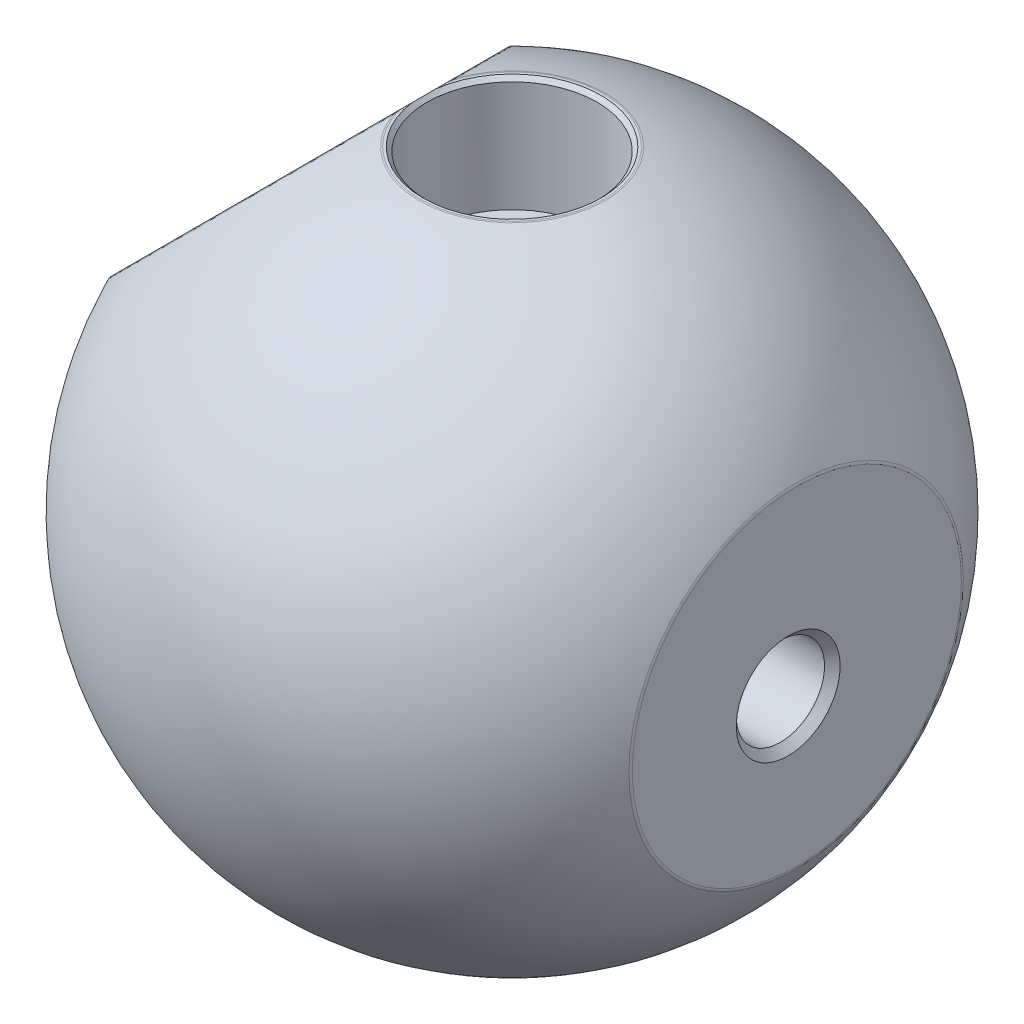
ISO-10303-21;
HEADER;
FILE_DESCRIPTION(('STEP AP214'),'2;1');
FILE_NAME('part.step','',(''),(''),'','','');
FILE_SCHEMA(('AUTOMOTIVE_DESIGN { 1 0 10303 214 1 1 1 1 }'));
ENDSEC;
DATA;
#1=APPLICATION_CONTEXT('core data for automotive mechanical design processes');
#2=APPLICATION_PROTOCOL_DEFINITION('international standard','automotive_design',2000,#1);
#3=PRODUCT_CONTEXT('',#1,'mechanical');
#4=PRODUCT('Part','Part','',(#3));
#5=PRODUCT_RELATED_PRODUCT_CATEGORY('part','',(#4));
#6=PRODUCT_DEFINITION_FORMATION('','',#4);
#7=PRODUCT_DEFINITION_CONTEXT('part definition',#1,'design');
#8=PRODUCT_DEFINITION('design','',#6,#7);
#9=PRODUCT_DEFINITION_SHAPE('','',#8);
#10=(LENGTH_UNIT() NAMED_UNIT(*) SI_UNIT(.MILLI.,.METRE.));
#11=(NAMED_UNIT(*) PLANE_ANGLE_UNIT() SI_UNIT($,.RADIAN.));
#12=(NAMED_UNIT(*) SI_UNIT($,.STERADIAN.) SOLID_ANGLE_UNIT());
#13=UNCERTAINTY_MEASURE_WITH_UNIT(LENGTH_MEASURE(1.E-05),#10,'distance_accuracy_value','');
#14=(GEOMETRIC_REPRESENTATION_CONTEXT(3) GLOBAL_UNCERTAINTY_ASSIGNED_CONTEXT((#13)) GLOBAL_UNIT_ASSIGNED_CONTEXT((#10,
#11,#12)) REPRESENTATION_CONTEXT('',''));
#15=CARTESIAN_POINT('',(0.,0.,0.));
#16=DIRECTION('',(0.,0.,1.));
#17=DIRECTION('',(1.,0.,0.));
#18=AXIS2_PLACEMENT_3D('',#15,#16,#17);
#19=CARTESIAN_POINT('',(0.,27.559,0.));
#20=DIRECTION('',(0.,-1.,0.));
#21=DIRECTION('',(1.,0.,0.));
#22=AXIS2_PLACEMENT_3D('',#19,#20,#21);
#23=SPHERICAL_SURFACE('',#22,31.75);
#24=CARTESIAN_POINT('',(0.,58.0183495934959,0.));
#25=DIRECTION('',(0.,-1.,0.));
#26=DIRECTION('',(0.,0.,-1.));
#27=AXIS2_PLACEMENT_3D('',#24,#25,#26);
#28=CIRCLE('',#27,8.96049788467133);
#29=CARTESIAN_POINT('',(-8.41858849162029,58.0183495934959,-3.06885811825145));
#30=VERTEX_POINT('',#29);
#31=CARTESIAN_POINT('',(-8.41858849162029,58.0183495934959,3.06885811825145));
#32=VERTEX_POINT('',#31);
#33=EDGE_CURVE('E239',#30,#32,#28,.T.);
#34=ORIENTED_EDGE('',*,*,#33,.T.);
#35=CARTESIAN_POINT('',(-19.4389690425581,46.9979690425583,0.));
#36=DIRECTION('',(0.707106781186544,-0.707106781186551,0.));
#37=DIRECTION('',(0.707106781186551,0.707106781186544,0.));
#38=AXIS2_PLACEMENT_3D('',#35,#36,#37);
#39=CIRCLE('',#38,15.8844409761542);
#40=EDGE_CURVE('E235',#32,#30,#39,.T.);
#41=ORIENTED_EDGE('',*,*,#40,.T.);
#42=EDGE_LOOP('',(#34,#41));
#43=FACE_BOUND('',#42,.T.);
#44=CARTESIAN_POINT('',(0.,0.0681463414634181,0.));
#45=DIRECTION('',(0.,1.,0.));
#46=DIRECTION('',(0.,0.,1.));
#47=AXIS2_PLACEMENT_3D('',#44,#45,#46);
#48=CIRCLE('',#47,15.8844409761542);
#49=CARTESIAN_POINT('',(0.,0.0681463414634181,15.8844409761542));
#50=VERTEX_POINT('',#49);
#51=EDGE_CURVE('E240',#50,#50,#48,.T.);
#52=ORIENTED_EDGE('',*,*,#51,.T.);
#53=EDGE_LOOP('',(#52));
#54=FACE_BOUND('',#53,.T.);
#55=CARTESIAN_POINT('',(27.3617886178862,27.559,0.));
#56=DIRECTION('',(-1.,0.,0.));
#57=DIRECTION('',(0.,0.,1.));
#58=AXIS2_PLACEMENT_3D('',#55,#56,#57);
#59=CIRCLE('',#58,16.1057450504506);
#60=CARTESIAN_POINT('',(27.3617886178862,27.559,16.1057450504506));
#61=VERTEX_POINT('',#60);
#62=EDGE_CURVE('E246',#61,#61,#59,.T.);
#63=ORIENTED_EDGE('',*,*,#62,.T.);
#64=EDGE_LOOP('',(#63));
#65=FACE_BOUND('',#64,.T.);
#66=ADVANCED_FACE('F45',(#43,#54,#65),#23,.T.);
#67=CARTESIAN_POINT('',(0.,58.039,0.));
#68=DIRECTION('',(0.,1.,0.));
#69=DIRECTION('',(0.,0.,1.));
#70=AXIS2_PLACEMENT_3D('',#67,#68,#69);
#71=PLANE('',#70);
#72=CARTESIAN_POINT('',(0.,58.039,0.));
#73=DIRECTION('',(0.,1.,0.));
#74=DIRECTION('',(0.,0.,1.));
#75=AXIS2_PLACEMENT_3D('',#72,#73,#74);
#76=CIRCLE('',#75,8.81712991851659);
#77=CARTESIAN_POINT('',(-8.47408837170127,58.039,2.43548891777351));
#78=VERTEX_POINT('',#77);
#79=CARTESIAN_POINT('',(-8.47408837170127,58.039,-2.43548891777352));
#80=VERTEX_POINT('',#79);
#81=EDGE_CURVE('E60',#78,#80,#76,.T.);
#82=ORIENTED_EDGE('',*,*,#81,.T.);
#83=CARTESIAN_POINT('',(-8.47408837170127,58.039,-2.43548891777352));
#84=CARTESIAN_POINT('',(-8.47874410026246,58.039,-2.36753710510322));
#85=CARTESIAN_POINT('',(-8.48224725954447,58.039,-2.29952521620221));
#86=CARTESIAN_POINT('',(-8.48760520189455,58.039,-2.16345260149654));
#87=CARTESIAN_POINT('',(-8.4894604377386,58.039,-2.09539189425168));
#88=CARTESIAN_POINT('',(-8.49218094780713,58.039,-1.95926476119611));
#89=CARTESIAN_POINT('',(-8.49304635598039,58.039,-1.89119833740606));
#90=CARTESIAN_POINT('',(-8.49410451695176,58.039,-1.75504145979182));
#91=CARTESIAN_POINT('',(-8.49429708905417,58.039,-1.6869510044231));
#92=CARTESIAN_POINT('',(-8.49431156544013,58.039,-1.61886226382374));
#93=B_SPLINE_CURVE_WITH_KNOTS('',3,(#83,#84,#85,#86,#87,#88,#89,#90,#91,#92),.UNSPECIFIED.,.F.,
.F.,(4,2,2,2,4),(0.,0.204297053443591,0.408537957774263,0.612751219857448,0.817019320885422),.UNSPECIFIED.);
#94=CARTESIAN_POINT('',(-8.49431156544002,58.039,-1.61886226382373));
#95=VERTEX_POINT('',#94);
#96=EDGE_CURVE('E209',#80,#95,#93,.T.);
#97=ORIENTED_EDGE('',*,*,#96,.T.);
#98=DIRECTION('',(0.,0.,1.));
#99=VECTOR('',#98,1.);
#100=CARTESIAN_POINT('',(-8.49431156544002,58.039,0.));
#101=LINE('',#100,#99);
#102=CARTESIAN_POINT('',(-8.49431156544002,58.039,-1.15517413372698));
#103=VERTEX_POINT('',#102);
#104=EDGE_CURVE('E118',#95,#103,#101,.T.);
#105=ORIENTED_EDGE('',*,*,#104,.T.);
#106=CARTESIAN_POINT('',(0.,58.039,0.));
#107=DIRECTION('',(0.,1.,0.));
#108=DIRECTION('',(0.,0.,1.));
#109=AXIS2_PLACEMENT_3D('',#106,#107,#108);
#110=CIRCLE('',#109,8.5725);
#111=CARTESIAN_POINT('',(-8.49431156544002,58.039,1.15517413372698));
#112=VERTEX_POINT('',#111);
#113=EDGE_CURVE('E140',#103,#112,#110,.F.);
#114=ORIENTED_EDGE('',*,*,#113,.T.);
#115=CARTESIAN_POINT('',(-8.49431156544002,58.039,1.61886226382373));
#116=VERTEX_POINT('',#115);
#117=EDGE_CURVE('E116',#112,#116,#101,.T.);
#118=ORIENTED_EDGE('',*,*,#117,.T.);
#119=CARTESIAN_POINT('',(-8.49431156544002,58.039,1.61886226382373));
#120=CARTESIAN_POINT('',(-8.49429708905413,58.039,1.68695100442309));
#121=CARTESIAN_POINT('',(-8.49410451695174,58.039,1.75504145979181));
#122=CARTESIAN_POINT('',(-8.4930463559804,58.039,1.89119833740605));
#123=CARTESIAN_POINT('',(-8.49218094780713,58.039,1.95926476119611));
#124=CARTESIAN_POINT('',(-8.48946043773859,58.039,2.09539189425167));
#125=CARTESIAN_POINT('',(-8.48760520189453,58.039,2.16345260149653));
#126=CARTESIAN_POINT('',(-8.48224725954449,58.039,2.2995252162022));
#127=CARTESIAN_POINT('',(-8.47874410026252,58.039,2.36753710510321));
#128=CARTESIAN_POINT('',(-8.47408837170143,58.039,2.43548891777351));
#129=B_SPLINE_CURVE_WITH_KNOTS('',3,(#119,#120,#121,#122,#123,#124,#125,#126,#127,#128),
.UNSPECIFIED.,.F.,.F.,(4,2,2,2,4),(0.,0.204268101027973,0.408481363111158,0.612722267441827,
0.817019320885414),.UNSPECIFIED.);
#130=EDGE_CURVE('E65',#116,#78,#129,.T.);
#131=ORIENTED_EDGE('',*,*,#130,.T.);
#132=EDGE_LOOP('',(#82,#97,#105,#114,#118,#131));
#133=FACE_BOUND('',#132,.T.);
#134=ADVANCED_FACE('F191',(#133),#71,.T.);
#135=CARTESIAN_POINT('',(0.,58.039,0.));
#136=DIRECTION('',(0.,1.,0.));
#137=DIRECTION('',(0.,0.,1.));
#138=AXIS2_PLACEMENT_3D('',#135,#136,#137);
#139=CONICAL_SURFACE('',#138,8.5725,0.785398163397444);
#140=CARTESIAN_POINT('',(0.,57.658,0.));
#141=DIRECTION('',(0.,1.,0.));
#142=DIRECTION('',(0.,0.,1.));
#143=AXIS2_PLACEMENT_3D('',#140,#141,#142);
#144=CIRCLE('',#143,8.1915);
#145=CARTESIAN_POINT('',(0.,57.658,8.1915));
#146=VERTEX_POINT('',#145);
#147=EDGE_CURVE('E143',#146,#146,#144,.T.);
#148=ORIENTED_EDGE('',*,*,#147,.F.);
#149=EDGE_LOOP('',(#148));
#150=FACE_BOUND('',#149,.T.);
#151=ORIENTED_EDGE('',*,*,#113,.F.);
#152=CARTESIAN_POINT('',(-8.49411156544002,58.0392,-1.15812521078595));
#153=CARTESIAN_POINT('',(-8.52030771029335,58.0130038551467,-0.772083473857303));
#154=CARTESIAN_POINT('',(-8.53340578272001,57.99990578272,-0.386041736928653));
#155=CARTESIAN_POINT('',(-8.53340578272001,57.99990578272,0.386041736928648));
#156=CARTESIAN_POINT('',(-8.52030771029335,58.0130038551467,0.772083473857299));
#157=CARTESIAN_POINT('',(-8.49411156544002,58.0392,1.15812521078595));
#158=B_SPLINE_CURVE_WITH_KNOTS('',3,(#152,#153,#154,#155,#156,#157),.UNSPECIFIED.,.F.,.F.,(4,2,
4),(0.,1.15945766411771,2.31891532823542),.UNSPECIFIED.);
#159=EDGE_CURVE('E146',#103,#112,#158,.T.);
#160=ORIENTED_EDGE('',*,*,#159,.T.);
#161=EDGE_LOOP('',(#151,#160));
#162=FACE_BOUND('',#161,.T.);
#163=ADVANCED_FACE('F156',(#150,#162),#139,.F.);
#164=CARTESIAN_POINT('',(0.,0.,0.));
#165=DIRECTION('',(0.,-1.,0.));
#166=DIRECTION('',(0.,0.,-1.));
#167=AXIS2_PLACEMENT_3D('',#164,#165,#166);
#168=CYLINDRICAL_SURFACE('',#167,5.207);
#169=CARTESIAN_POINT('',(0.,1.01600000000002,0.));
#170=DIRECTION('',(0.,-1.,0.));
#171=DIRECTION('',(0.,0.,-1.));
#172=AXIS2_PLACEMENT_3D('',#169,#170,#171);
#173=CIRCLE('',#172,5.207);
#174=CARTESIAN_POINT('',(0.,1.01600000000002,-5.207));
#175=VERTEX_POINT('',#174);
#176=EDGE_CURVE('E248',#175,#175,#173,.T.);
#177=ORIENTED_EDGE('',*,*,#176,.T.);
#178=EDGE_LOOP('',(#177));
#179=FACE_BOUND('',#178,.T.);
#180=CARTESIAN_POINT('',(0.,46.99,0.));
#181=DIRECTION('',(0.,-1.,0.));
#182=DIRECTION('',(0.,0.,-1.));
#183=AXIS2_PLACEMENT_3D('',#180,#181,#182);
#184=CIRCLE('',#183,5.207);
#185=CARTESIAN_POINT('',(0.,46.99,-5.207));
#186=VERTEX_POINT('',#185);
#187=EDGE_CURVE('E137',#186,#186,#184,.T.);
#188=ORIENTED_EDGE('',*,*,#187,.F.);
#189=EDGE_LOOP('',(#188));
#190=FACE_BOUND('',#189,.T.);
#191=ADVANCED_FACE('F200',(#179,#190),#168,.F.);
#192=CARTESIAN_POINT('',(15.7659131990507,0.,0.));
#193=DIRECTION('',(0.,-1.,0.));
#194=DIRECTION('',(0.,0.,-1.));
#195=AXIS2_PLACEMENT_3D('',#192,#193,#194);
#196=PLANE('',#195);
#197=CARTESIAN_POINT('',(0.,0.,0.));
#198=DIRECTION('',(0.,-1.,0.));
#199=DIRECTION('',(0.,0.,-1.));
#200=AXIS2_PLACEMENT_3D('',#197,#198,#199);
#201=CIRCLE('',#200,15.6302899205357);
#202=CARTESIAN_POINT('',(0.,0.,-15.6302899205357));
#203=VERTEX_POINT('',#202);
#204=EDGE_CURVE('E53',#203,#203,#201,.T.);
#205=ORIENTED_EDGE('',*,*,#204,.T.);
#206=EDGE_LOOP('',(#205));
#207=FACE_BOUND('',#206,.T.);
#208=CARTESIAN_POINT('',(0.,0.,0.));
#209=DIRECTION('',(0.,-1.,0.));
#210=DIRECTION('',(0.,0.,-1.));
#211=AXIS2_PLACEMENT_3D('',#208,#209,#210);
#212=CIRCLE('',#211,9.779);
#213=CARTESIAN_POINT('',(0.,0.,-9.779));
#214=VERTEX_POINT('',#213);
#215=EDGE_CURVE('E128',#214,#214,#212,.T.);
#216=ORIENTED_EDGE('',*,*,#215,.F.);
#217=EDGE_LOOP('',(#216));
#218=FACE_BOUND('',#217,.T.);
#219=ADVANCED_FACE('F47',(#207,#218),#196,.T.);
#220=CARTESIAN_POINT('',(8.1915,46.99,0.));
#221=DIRECTION('',(0.,-1.,0.));
#222=DIRECTION('',(0.,0.,-1.));
#223=AXIS2_PLACEMENT_3D('',#220,#221,#222);
#224=PLANE('',#223);
#225=CARTESIAN_POINT('',(0.,46.99,0.));
#226=DIRECTION('',(0.,-1.,0.));
#227=DIRECTION('',(0.,0.,-1.));
#228=AXIS2_PLACEMENT_3D('',#225,#226,#227);
#229=CIRCLE('',#228,8.1915);
#230=CARTESIAN_POINT('',(0.,46.99,-8.1915));
#231=VERTEX_POINT('',#230);
#232=EDGE_CURVE('E134',#231,#231,#229,.T.);
#233=ORIENTED_EDGE('',*,*,#232,.F.);
#234=EDGE_LOOP('',(#233));
#235=FACE_BOUND('',#234,.T.);
#236=ORIENTED_EDGE('',*,*,#187,.T.);
#237=EDGE_LOOP('',(#236));
#238=FACE_BOUND('',#237,.T.);
#239=ADVANCED_FACE('F335',(#235,#238),#224,.F.);
#240=CARTESIAN_POINT('',(0.,0.,0.));
#241=DIRECTION('',(0.,-1.,0.));
#242=DIRECTION('',(0.,0.,-1.));
#243=AXIS2_PLACEMENT_3D('',#240,#241,#242);
#244=CYLINDRICAL_SURFACE('',#243,8.1915);
#245=ORIENTED_EDGE('',*,*,#147,.T.);
#246=EDGE_LOOP('',(#245));
#247=FACE_BOUND('',#246,.T.);
#248=ORIENTED_EDGE('',*,*,#232,.T.);
#249=EDGE_LOOP('',(#248));
#250=FACE_BOUND('',#249,.T.);
#251=ADVANCED_FACE('F361',(#247,#250),#244,.F.);
#252=CARTESIAN_POINT('',(0.,0.635,0.));
#253=DIRECTION('',(0.,-1.,0.));
#254=DIRECTION('',(0.,0.,-1.));
#255=AXIS2_PLACEMENT_3D('',#252,#253,#254);
#256=PLANE('',#255);
#257=CARTESIAN_POINT('',(0.,0.635,0.));
#258=DIRECTION('',(0.,-1.,0.));
#259=DIRECTION('',(0.,0.,-1.));
#260=AXIS2_PLACEMENT_3D('',#257,#258,#259);
#261=CIRCLE('',#260,5.58800000000002);
#262=CARTESIAN_POINT('',(0.,0.635,-5.58800000000002));
#263=VERTEX_POINT('',#262);
#264=EDGE_CURVE('E154',#263,#263,#261,.F.);
#265=ORIENTED_EDGE('',*,*,#264,.T.);
#266=EDGE_LOOP('',(#265));
#267=FACE_BOUND('',#266,.T.);
#268=CARTESIAN_POINT('',(0.,0.635,0.));
#269=DIRECTION('',(0.,-1.,0.));
#270=DIRECTION('',(0.,0.,-1.));
#271=AXIS2_PLACEMENT_3D('',#268,#269,#270);
#272=CIRCLE('',#271,9.144);
#273=CARTESIAN_POINT('',(0.,0.635,-9.144));
#274=VERTEX_POINT('',#273);
#275=EDGE_CURVE('E131',#274,#274,#272,.T.);
#276=ORIENTED_EDGE('',*,*,#275,.T.);
#277=EDGE_LOOP('',(#276));
#278=FACE_BOUND('',#277,.T.);
#279=ADVANCED_FACE('F186',(#267,#278),#256,.T.);
#280=CARTESIAN_POINT('',(0.,0.,0.));
#281=DIRECTION('',(0.,-1.,0.));
#282=DIRECTION('',(0.,0.,-1.));
#283=AXIS2_PLACEMENT_3D('',#280,#281,#282);
#284=CONICAL_SURFACE('',#283,9.779,0.78539816339745);
#285=ORIENTED_EDGE('',*,*,#275,.F.);
#286=EDGE_LOOP('',(#285));
#287=FACE_BOUND('',#286,.T.);
#288=ORIENTED_EDGE('',*,*,#215,.T.);
#289=EDGE_LOOP('',(#288));
#290=FACE_BOUND('',#289,.T.);
#291=ADVANCED_FACE('F181',(#287,#290),#284,.F.);
#292=CARTESIAN_POINT('',(27.432,0.,0.));
#293=DIRECTION('',(1.,0.,0.));
#294=DIRECTION('',(0.,0.,-1.));
#295=AXIS2_PLACEMENT_3D('',#292,#293,#294);
#296=PLANE('',#295);
#297=CARTESIAN_POINT('',(27.432,27.559,0.));
#298=DIRECTION('',(1.,0.,0.));
#299=DIRECTION('',(0.,0.,-1.));
#300=AXIS2_PLACEMENT_3D('',#297,#298,#299);
#301=CIRCLE('',#300,15.8480531296434);
#302=CARTESIAN_POINT('',(27.432,27.559,-15.8480531296434));
#303=VERTEX_POINT('',#302);
#304=EDGE_CURVE('E14',#303,#303,#301,.T.);
#305=ORIENTED_EDGE('',*,*,#304,.T.);
#306=EDGE_LOOP('',(#305));
#307=FACE_BOUND('',#306,.T.);
#308=CARTESIAN_POINT('',(27.432,26.3496668216874,0.831479588498496));
#309=DIRECTION('',(1.,0.,0.));
#310=DIRECTION('',(0.,0.,-1.));
#311=AXIS2_PLACEMENT_3D('',#308,#309,#310);
#312=CIRCLE('',#311,5.);
#313=CARTESIAN_POINT('',(27.432,26.3496668216874,-4.1685204115015));
#314=VERTEX_POINT('',#313);
#315=EDGE_CURVE('E125',#314,#314,#312,.T.);
#316=ORIENTED_EDGE('',*,*,#315,.F.);
#317=EDGE_LOOP('',(#316));
#318=FACE_BOUND('',#317,.T.);
#319=ADVANCED_FACE('F178',(#307,#318),#296,.T.);
#320=CARTESIAN_POINT('',(27.432,26.3496668216874,0.831479588498496));
#321=DIRECTION('',(1.,0.,0.));
#322=DIRECTION('',(0.,0.,-1.));
#323=AXIS2_PLACEMENT_3D('',#320,#321,#322);
#324=CONICAL_SURFACE('',#323,5.,0.785398163397448);
#325=CARTESIAN_POINT('',(26.682,26.3496668216874,0.831479588498496));
#326=DIRECTION('',(1.,0.,0.));
#327=DIRECTION('',(0.,0.,-1.));
#328=AXIS2_PLACEMENT_3D('',#325,#326,#327);
#329=CIRCLE('',#328,4.25);
#330=CARTESIAN_POINT('',(26.682,26.3496668216874,-3.4185204115015));
#331=VERTEX_POINT('',#330);
#332=EDGE_CURVE('E122',#331,#331,#329,.T.);
#333=ORIENTED_EDGE('',*,*,#332,.F.);
#334=EDGE_LOOP('',(#333));
#335=FACE_BOUND('',#334,.T.);
#336=ORIENTED_EDGE('',*,*,#315,.T.);
#337=EDGE_LOOP('',(#336));
#338=FACE_BOUND('',#337,.T.);
#339=ADVANCED_FACE('F175',(#335,#338),#324,.F.);
#340=CARTESIAN_POINT('',(27.432,26.3496668216874,0.831479588498496));
#341=DIRECTION('',(1.,0.,0.));
#342=DIRECTION('',(0.,0.,-1.));
#343=AXIS2_PLACEMENT_3D('',#340,#341,#342);
#344=CYLINDRICAL_SURFACE('',#343,4.25);
#345=CARTESIAN_POINT('',(10.5664,26.3496668216874,0.831479588498496));
#346=DIRECTION('',(1.,0.,0.));
#347=DIRECTION('',(0.,0.,-1.));
#348=AXIS2_PLACEMENT_3D('',#345,#346,#347);
#349=CIRCLE('',#348,4.25);
#350=CARTESIAN_POINT('',(10.5664,26.3496668216874,-3.4185204115015));
#351=VERTEX_POINT('',#350);
#352=EDGE_CURVE('E119',#351,#351,#349,.T.);
#353=ORIENTED_EDGE('',*,*,#352,.F.);
#354=EDGE_LOOP('',(#353));
#355=FACE_BOUND('',#354,.T.);
#356=ORIENTED_EDGE('',*,*,#332,.T.);
#357=EDGE_LOOP('',(#356));
#358=FACE_BOUND('',#357,.T.);
#359=ADVANCED_FACE('F171',(#355,#358),#344,.F.);
#360=CARTESIAN_POINT('',(10.5664,26.3496668216874,0.831479588498496));
#361=DIRECTION('',(1.,0.,0.));
#362=DIRECTION('',(0.,0.,-1.));
#363=AXIS2_PLACEMENT_3D('',#360,#361,#362);
#364=CONICAL_SURFACE('',#363,4.25,1.02974425867665);
#365=CARTESIAN_POINT('',(8.01274236913287,26.3496668216874,0.831479588498496));
#366=VERTEX_POINT('',#365);
#367=VERTEX_LOOP('',#366);
#368=FACE_BOUND('',#367,.T.);
#369=ORIENTED_EDGE('',*,*,#352,.T.);
#370=EDGE_LOOP('',(#369));
#371=FACE_BOUND('',#370,.T.);
#372=ADVANCED_FACE('F166',(#368,#371),#364,.F.);
#373=CARTESIAN_POINT('',(-19.48715578272,47.0461557827202,0.));
#374=DIRECTION('',(-0.707106781186544,0.707106781186551,0.));
#375=DIRECTION('',(-0.707106781186551,-0.707106781186544,0.));
#376=AXIS2_PLACEMENT_3D('',#373,#374,#375);
#377=PLANE('',#376);
#378=CARTESIAN_POINT('',(-19.48715578272,47.0461557827202,0.));
#379=DIRECTION('',(-0.707106781186544,0.707106781186551,0.));
#380=DIRECTION('',(-0.707106781186551,-0.707106781186544,0.));
#381=AXIS2_PLACEMENT_3D('',#378,#379,#380);
#382=CIRCLE('',#381,5.);
#383=CARTESIAN_POINT('',(-23.0226896886527,43.5106218767874,0.));
#384=VERTEX_POINT('',#383);
#385=EDGE_CURVE('E102',#384,#384,#382,.T.);
#386=ORIENTED_EDGE('',*,*,#385,.F.);
#387=EDGE_LOOP('',(#386));
#388=FACE_BOUND('',#387,.T.);
#389=ORIENTED_EDGE('',*,*,#104,.F.);
#390=CARTESIAN_POINT('',(-19.48715578272,47.0461557827202,0.));
#391=DIRECTION('',(-0.707106781186544,0.707106781186551,0.));
#392=DIRECTION('',(-0.707106781186551,-0.707106781186544,0.));
#393=AXIS2_PLACEMENT_3D('',#390,#391,#392);
#394=CIRCLE('',#393,15.6302899205357);
#395=EDGE_CURVE('E214',#95,#116,#394,.T.);
#396=ORIENTED_EDGE('',*,*,#395,.T.);
#397=ORIENTED_EDGE('',*,*,#117,.F.);
#398=ORIENTED_EDGE('',*,*,#159,.F.);
#399=EDGE_LOOP('',(#389,#396,#397,#398));
#400=FACE_BOUND('',#399,.T.);
#401=ADVANCED_FACE('F160',(#388,#400),#377,.T.);
#402=CARTESIAN_POINT('',(-19.48715578272,47.0461557827202,0.));
#403=DIRECTION('',(-0.707106781186544,0.707106781186551,0.));
#404=DIRECTION('',(-0.707106781186551,-0.707106781186544,0.));
#405=AXIS2_PLACEMENT_3D('',#402,#403,#404);
#406=CONICAL_SURFACE('',#405,5.,0.785398163397448);
#407=CARTESIAN_POINT('',(-18.9568256968301,46.5158256968302,0.));
#408=DIRECTION('',(-0.707106781186544,0.707106781186551,0.));
#409=DIRECTION('',(-0.707106781186551,-0.707106781186544,0.));
#410=AXIS2_PLACEMENT_3D('',#407,#408,#409);
#411=CIRCLE('',#410,4.25);
#412=CARTESIAN_POINT('',(-21.9620295168729,43.5106218767874,0.));
#413=VERTEX_POINT('',#412);
#414=EDGE_CURVE('E98',#413,#413,#411,.T.);
#415=ORIENTED_EDGE('',*,*,#414,.F.);
#416=EDGE_LOOP('',(#415));
#417=FACE_BOUND('',#416,.T.);
#418=ORIENTED_EDGE('',*,*,#385,.T.);
#419=EDGE_LOOP('',(#418));
#420=FACE_BOUND('',#419,.T.);
#421=ADVANCED_FACE('F165',(#417,#420),#406,.F.);
#422=CARTESIAN_POINT('',(-19.48715578272,47.0461557827202,0.));
#423=DIRECTION('',(-0.707106781186544,0.707106781186551,0.));
#424=DIRECTION('',(-0.707106781186551,-0.707106781186544,0.));
#425=AXIS2_PLACEMENT_3D('',#422,#423,#424);
#426=CYLINDRICAL_SURFACE('',#425,4.25);
#427=CARTESIAN_POINT('',(-9.35742687815402,36.9164268781541,0.));
#428=DIRECTION('',(-0.707106781186544,0.707106781186551,0.));
#429=DIRECTION('',(-0.707106781186551,-0.707106781186544,0.));
#430=AXIS2_PLACEMENT_3D('',#427,#428,#429);
#431=CIRCLE('',#430,4.25);
#432=CARTESIAN_POINT('',(-12.3626306981969,33.9112230581113,0.));
#433=VERTEX_POINT('',#432);
#434=EDGE_CURVE('E96',#433,#433,#431,.T.);
#435=ORIENTED_EDGE('',*,*,#434,.F.);
#436=EDGE_LOOP('',(#435));
#437=FACE_BOUND('',#436,.T.);
#438=ORIENTED_EDGE('',*,*,#414,.T.);
#439=EDGE_LOOP('',(#438));
#440=FACE_BOUND('',#439,.T.);
#441=ADVANCED_FACE('F92',(#437,#440),#426,.F.);
#442=CARTESIAN_POINT('',(-9.35742687815402,36.9164268781541,0.));
#443=DIRECTION('',(-0.707106781186544,0.707106781186551,0.));
#444=DIRECTION('',(-0.707106781186551,-0.707106781186544,0.));
#445=AXIS2_PLACEMENT_3D('',#442,#443,#444);
#446=CONICAL_SURFACE('',#445,4.25,1.02974425867665);
#447=CARTESIAN_POINT('',(-7.5517182505391,35.1107182505392,0.));
#448=VERTEX_POINT('',#447);
#449=VERTEX_LOOP('',#448);
#450=FACE_BOUND('',#449,.T.);
#451=ORIENTED_EDGE('',*,*,#434,.T.);
#452=EDGE_LOOP('',(#451));
#453=FACE_BOUND('',#452,.T.);
#454=ADVANCED_FACE('F88',(#450,#453),#446,.F.);
#455=CARTESIAN_POINT('',(0.,0.635,0.));
#456=DIRECTION('',(0.,-1.,0.));
#457=DIRECTION('',(0.,0.,-1.));
#458=AXIS2_PLACEMENT_3D('',#455,#456,#457);
#459=CONICAL_SURFACE('',#458,5.58800000000002,0.785398163397449);
#460=ORIENTED_EDGE('',*,*,#176,.F.);
#461=EDGE_LOOP('',(#460));
#462=FACE_BOUND('',#461,.T.);
#463=ORIENTED_EDGE('',*,*,#264,.F.);
#464=EDGE_LOOP('',(#463));
#465=FACE_BOUND('',#464,.T.);
#466=ADVANCED_FACE('F91',(#462,#465),#459,.F.);
#467=CARTESIAN_POINT('',(0.,57.531,0.));
#468=DIRECTION('',(0.,1.,0.));
#469=DIRECTION('',(0.,0.,1.));
#470=AXIS2_PLACEMENT_3D('',#467,#468,#469);
#471=TOROIDAL_SURFACE('',#470,8.81712991851659,0.508);
#472=CARTESIAN_POINT('',(-8.47408837170127,58.039,-2.43548891777352));
#473=CARTESIAN_POINT('',(-8.46678146296566,58.0389733406879,-2.54021226556605));
#474=CARTESIAN_POINT('',(-8.45863252008859,58.0375785138785,-2.64492823141977));
#475=CARTESIAN_POINT('',(-8.44043600209417,58.0311468111822,-2.8539812426317));
#476=CARTESIAN_POINT('',(-8.43039015299918,58.0261132345608,-2.95831854525542));
#477=CARTESIAN_POINT('',(-8.41905094954779,58.0186557746835,-3.06453924609579));
#478=CARTESIAN_POINT('',(-8.41881994995792,58.0185031754477,-3.06669874225741));
#479=CARTESIAN_POINT('',(-8.41858849162042,58.0183495934959,-3.06885811825109));
#480=B_SPLINE_CURVE_WITH_KNOTS('',3,(#472,#473,#474,#475,#476,#477,#478,#479),.UNSPECIFIED.,.F.,
.F.,(4,2,2,4),(0.,0.315006182835886,0.62972710628715,0.636258616725557),.UNSPECIFIED.);
#481=EDGE_CURVE('E105',#80,#30,#480,.T.);
#482=ORIENTED_EDGE('',*,*,#481,.F.);
#483=ORIENTED_EDGE('',*,*,#81,.F.);
#484=CARTESIAN_POINT('',(-8.47408837170127,58.039,2.43548891777351));
#485=CARTESIAN_POINT('',(-8.4667814629665,58.0389733406876,2.54021226556612));
#486=CARTESIAN_POINT('',(-8.45863252008901,58.0375785138783,2.6449282314198));
#487=CARTESIAN_POINT('',(-8.44043600209374,58.0311468111824,2.85398124263166));
#488=CARTESIAN_POINT('',(-8.43039015299832,58.0261132345612,2.95831854525535));
#489=CARTESIAN_POINT('',(-8.41905094954775,58.0186557746835,3.06453924609579));
#490=CARTESIAN_POINT('',(-8.4188199499579,58.0185031754477,3.06669874225741));
#491=CARTESIAN_POINT('',(-8.41858849162042,58.0183495934959,3.06885811825109));
#492=B_SPLINE_CURVE_WITH_KNOTS('',3,(#484,#485,#486,#487,#488,#489,#490,#491),.UNSPECIFIED.,.F.,
.F.,(4,2,2,4),(0.,0.315006182835885,0.629727106287156,0.636258616725562),.UNSPECIFIED.);
#493=EDGE_CURVE('E99',#32,#78,#492,.F.);
#494=ORIENTED_EDGE('',*,*,#493,.F.);
#495=ORIENTED_EDGE('',*,*,#33,.F.);
#496=EDGE_LOOP('',(#482,#483,#494,#495));
#497=FACE_BOUND('',#496,.T.);
#498=ADVANCED_FACE('F220',(#497),#471,.T.);
#499=CARTESIAN_POINT('',(-19.1279455378772,46.6869455378774,0.));
#500=DIRECTION('',(-0.707106781186544,0.707106781186551,0.));
#501=DIRECTION('',(-0.707106781186551,-0.707106781186544,0.));
#502=AXIS2_PLACEMENT_3D('',#499,#500,#501);
#503=TOROIDAL_SURFACE('',#502,15.6302899205357,0.508);
#504=ORIENTED_EDGE('',*,*,#130,.F.);
#505=ORIENTED_EDGE('',*,*,#395,.F.);
#506=ORIENTED_EDGE('',*,*,#96,.F.);
#507=ORIENTED_EDGE('',*,*,#481,.T.);
#508=ORIENTED_EDGE('',*,*,#40,.F.);
#509=ORIENTED_EDGE('',*,*,#493,.T.);
#510=EDGE_LOOP('',(#504,#505,#506,#507,#508,#509));
#511=FACE_BOUND('',#510,.T.);
#512=ADVANCED_FACE('F215',(#511),#503,.T.);
#513=CARTESIAN_POINT('',(0.,0.508000000000002,0.));
#514=DIRECTION('',(0.,-1.,0.));
#515=DIRECTION('',(0.,0.,-1.));
#516=AXIS2_PLACEMENT_3D('',#513,#514,#515);
#517=TOROIDAL_SURFACE('',#516,15.6302899205357,0.508);
#518=ORIENTED_EDGE('',*,*,#51,.F.);
#519=EDGE_LOOP('',(#518));
#520=FACE_BOUND('',#519,.T.);
#521=ORIENTED_EDGE('',*,*,#204,.F.);
#522=EDGE_LOOP('',(#521));
#523=FACE_BOUND('',#522,.T.);
#524=ADVANCED_FACE('F219',(#520,#523),#517,.T.);
#525=CARTESIAN_POINT('',(26.924,27.559,0.));
#526=DIRECTION('',(1.,0.,0.));
#527=DIRECTION('',(0.,0.,-1.));
#528=AXIS2_PLACEMENT_3D('',#525,#526,#527);
#529=TOROIDAL_SURFACE('',#528,15.8480531296434,0.508);
#530=ORIENTED_EDGE('',*,*,#304,.F.);
#531=EDGE_LOOP('',(#530));
#532=FACE_BOUND('',#531,.T.);
#533=ORIENTED_EDGE('',*,*,#62,.F.);
#534=EDGE_LOOP('',(#533));
#535=FACE_BOUND('',#534,.T.);
#536=ADVANCED_FACE('F282',(#532,#535),#529,.T.);
#537=CLOSED_SHELL('',(#66,#134,#163,#191,#219,#239,#251,#279,#291,#319,#339,#359,#372,#401,#421,
#441,#454,#466,#498,#512,#524,#536));
#538=MANIFOLD_SOLID_BREP('B2',#537);
#539=ADVANCED_BREP_SHAPE_REPRESENTATION('',(#18,#538),#14);
#540=SHAPE_DEFINITION_REPRESENTATION(#9,#539);
ENDSEC;
END-ISO-10303-21;
